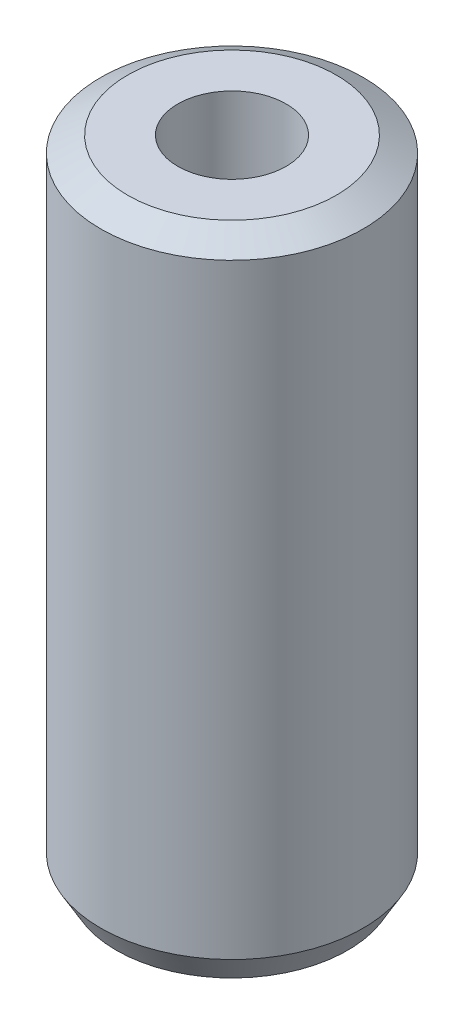
ISO-10303-21;
HEADER;
FILE_DESCRIPTION(('STEP AP214'),'2;1');
FILE_NAME('part.step','',(''),(''),'','','');
FILE_SCHEMA(('AUTOMOTIVE_DESIGN { 1 0 10303 214 1 1 1 1 }'));
ENDSEC;
DATA;
#1=APPLICATION_CONTEXT('core data for automotive mechanical design processes');
#2=APPLICATION_PROTOCOL_DEFINITION('international standard','automotive_design',2000,#1);
#3=PRODUCT_CONTEXT('',#1,'mechanical');
#4=PRODUCT('Part','Part','',(#3));
#5=PRODUCT_RELATED_PRODUCT_CATEGORY('part','',(#4));
#6=PRODUCT_DEFINITION_FORMATION('','',#4);
#7=PRODUCT_DEFINITION_CONTEXT('part definition',#1,'design');
#8=PRODUCT_DEFINITION('design','',#6,#7);
#9=PRODUCT_DEFINITION_SHAPE('','',#8);
#10=(LENGTH_UNIT() NAMED_UNIT(*) SI_UNIT(.MILLI.,.METRE.));
#11=(NAMED_UNIT(*) PLANE_ANGLE_UNIT() SI_UNIT($,.RADIAN.));
#12=(NAMED_UNIT(*) SI_UNIT($,.STERADIAN.) SOLID_ANGLE_UNIT());
#13=UNCERTAINTY_MEASURE_WITH_UNIT(LENGTH_MEASURE(1.E-05),#10,'distance_accuracy_value','');
#14=(GEOMETRIC_REPRESENTATION_CONTEXT(3) GLOBAL_UNCERTAINTY_ASSIGNED_CONTEXT((#13)) GLOBAL_UNIT_ASSIGNED_CONTEXT((#10,
#11,#12)) REPRESENTATION_CONTEXT('',''));
#15=CARTESIAN_POINT('',(0.,0.,0.));
#16=DIRECTION('',(0.,0.,1.));
#17=DIRECTION('',(1.,0.,0.));
#18=AXIS2_PLACEMENT_3D('',#15,#16,#17);
#19=CARTESIAN_POINT('',(0.,234.524475339602,0.));
#20=DIRECTION('',(0.,-1.,0.));
#21=DIRECTION('',(0.,0.,-1.));
#22=AXIS2_PLACEMENT_3D('',#19,#20,#21);
#23=CYLINDRICAL_SURFACE('',#22,47.5);
#24=CARTESIAN_POINT('',(0.,228.879236643106,0.));
#25=DIRECTION('',(0.,1.,0.));
#26=DIRECTION('',(0.,0.,1.));
#27=AXIS2_PLACEMENT_3D('',#24,#25,#26);
#28=CIRCLE('',#27,47.5);
#29=CARTESIAN_POINT('',(0.,228.879236643106,47.5));
#30=VERTEX_POINT('',#29);
#31=EDGE_CURVE('E50',#30,#30,#28,.F.);
#32=ORIENTED_EDGE('',*,*,#31,.T.);
#33=EDGE_LOOP('',(#32));
#34=FACE_BOUND('',#33,.T.);
#35=CARTESIAN_POINT('',(0.,9.7778402431849,0.));
#36=DIRECTION('',(0.,1.,0.));
#37=DIRECTION('',(0.,0.,1.));
#38=AXIS2_PLACEMENT_3D('',#35,#36,#37);
#39=CIRCLE('',#38,47.5);
#40=CARTESIAN_POINT('',(0.,9.7778402431849,47.5));
#41=VERTEX_POINT('',#40);
#42=EDGE_CURVE('E51',#41,#41,#39,.T.);
#43=ORIENTED_EDGE('',*,*,#42,.T.);
#44=EDGE_LOOP('',(#43));
#45=FACE_BOUND('',#44,.T.);
#46=ADVANCED_FACE('F39',(#34,#45),#23,.T.);
#47=CARTESIAN_POINT('',(0.,234.524475339602,0.));
#48=DIRECTION('',(0.,1.,0.));
#49=DIRECTION('',(0.,0.,1.));
#50=AXIS2_PLACEMENT_3D('',#47,#48,#49);
#51=PLANE('',#50);
#52=CARTESIAN_POINT('',(0.,234.524475339602,0.));
#53=DIRECTION('',(0.,1.,0.));
#54=DIRECTION('',(0.,0.,1.));
#55=AXIS2_PLACEMENT_3D('',#52,#53,#54);
#56=CIRCLE('',#55,37.7221597568152);
#57=CARTESIAN_POINT('',(0.,234.524475339602,37.7221597568152));
#58=VERTEX_POINT('',#57);
#59=EDGE_CURVE('E54',#58,#58,#56,.T.);
#60=ORIENTED_EDGE('',*,*,#59,.T.);
#61=EDGE_LOOP('',(#60));
#62=FACE_BOUND('',#61,.T.);
#63=CARTESIAN_POINT('',(0.,234.524475339602,0.));
#64=DIRECTION('',(0.,1.,0.));
#65=DIRECTION('',(0.,0.,1.));
#66=AXIS2_PLACEMENT_3D('',#63,#64,#65);
#67=CIRCLE('',#66,19.5971002493432);
#68=CARTESIAN_POINT('',(0.,234.524475339602,19.5971002493432));
#69=VERTEX_POINT('',#68);
#70=EDGE_CURVE('E58',#69,#69,#67,.T.);
#71=ORIENTED_EDGE('',*,*,#70,.F.);
#72=EDGE_LOOP('',(#71));
#73=FACE_BOUND('',#72,.T.);
#74=ADVANCED_FACE('F69',(#62,#73),#51,.T.);
#75=CARTESIAN_POINT('',(0.,0.,0.));
#76=DIRECTION('',(0.,1.,0.));
#77=DIRECTION('',(0.,0.,1.));
#78=AXIS2_PLACEMENT_3D('',#75,#76,#77);
#79=PLANE('',#78);
#80=CARTESIAN_POINT('',(0.,0.,0.));
#81=DIRECTION('',(0.,1.,0.));
#82=DIRECTION('',(0.,0.,1.));
#83=AXIS2_PLACEMENT_3D('',#80,#81,#82);
#84=CIRCLE('',#83,41.854761303504);
#85=CARTESIAN_POINT('',(0.,0.,41.854761303504));
#86=VERTEX_POINT('',#85);
#87=EDGE_CURVE('E10',#86,#86,#84,.F.);
#88=ORIENTED_EDGE('',*,*,#87,.T.);
#89=EDGE_LOOP('',(#88));
#90=FACE_BOUND('',#89,.T.);
#91=CARTESIAN_POINT('',(0.,0.,0.));
#92=DIRECTION('',(0.,1.,0.));
#93=DIRECTION('',(0.,0.,1.));
#94=AXIS2_PLACEMENT_3D('',#91,#92,#93);
#95=CIRCLE('',#94,19.5971002493432);
#96=CARTESIAN_POINT('',(0.,0.,19.5971002493432));
#97=VERTEX_POINT('',#96);
#98=EDGE_CURVE('E63',#97,#97,#95,.T.);
#99=ORIENTED_EDGE('',*,*,#98,.T.);
#100=EDGE_LOOP('',(#99));
#101=FACE_BOUND('',#100,.T.);
#102=ADVANCED_FACE('F75',(#90,#101),#79,.F.);
#103=CARTESIAN_POINT('',(0.,234.524475339602,0.));
#104=DIRECTION('',(0.,-1.,0.));
#105=DIRECTION('',(0.,0.,-1.));
#106=AXIS2_PLACEMENT_3D('',#103,#104,#105);
#107=CYLINDRICAL_SURFACE('',#106,19.5971002493432);
#108=ORIENTED_EDGE('',*,*,#70,.T.);
#109=EDGE_LOOP('',(#108));
#110=FACE_BOUND('',#109,.T.);
#111=ORIENTED_EDGE('',*,*,#98,.F.);
#112=EDGE_LOOP('',(#111));
#113=FACE_BOUND('',#112,.T.);
#114=ADVANCED_FACE('F70',(#110,#113),#107,.F.);
#115=CARTESIAN_POINT('',(0.,234.524475339602,0.));
#116=DIRECTION('',(0.,-1.,0.));
#117=DIRECTION('',(0.,0.,-1.));
#118=AXIS2_PLACEMENT_3D('',#115,#116,#117);
#119=CONICAL_SURFACE('',#118,37.7221597568152,1.04719755119659);
#120=ORIENTED_EDGE('',*,*,#31,.F.);
#121=EDGE_LOOP('',(#120));
#122=FACE_BOUND('',#121,.T.);
#123=ORIENTED_EDGE('',*,*,#59,.F.);
#124=EDGE_LOOP('',(#123));
#125=FACE_BOUND('',#124,.T.);
#126=ADVANCED_FACE('F81',(#122,#125),#119,.T.);
#127=CARTESIAN_POINT('',(0.,9.7778402431849,0.));
#128=DIRECTION('',(0.,1.,0.));
#129=DIRECTION('',(0.,0.,1.));
#130=AXIS2_PLACEMENT_3D('',#127,#128,#129);
#131=CONICAL_SURFACE('',#130,47.5,0.523598775598303);
#132=ORIENTED_EDGE('',*,*,#87,.F.);
#133=EDGE_LOOP('',(#132));
#134=FACE_BOUND('',#133,.T.);
#135=ORIENTED_EDGE('',*,*,#42,.F.);
#136=EDGE_LOOP('',(#135));
#137=FACE_BOUND('',#136,.T.);
#138=ADVANCED_FACE('F45',(#134,#137),#131,.T.);
#139=CLOSED_SHELL('',(#46,#74,#102,#114,#126,#138));
#140=MANIFOLD_SOLID_BREP('B2',#139);
#141=ADVANCED_BREP_SHAPE_REPRESENTATION('',(#18,#140),#14);
#142=SHAPE_DEFINITION_REPRESENTATION(#9,#141);
ENDSEC;
END-ISO-10303-21;
